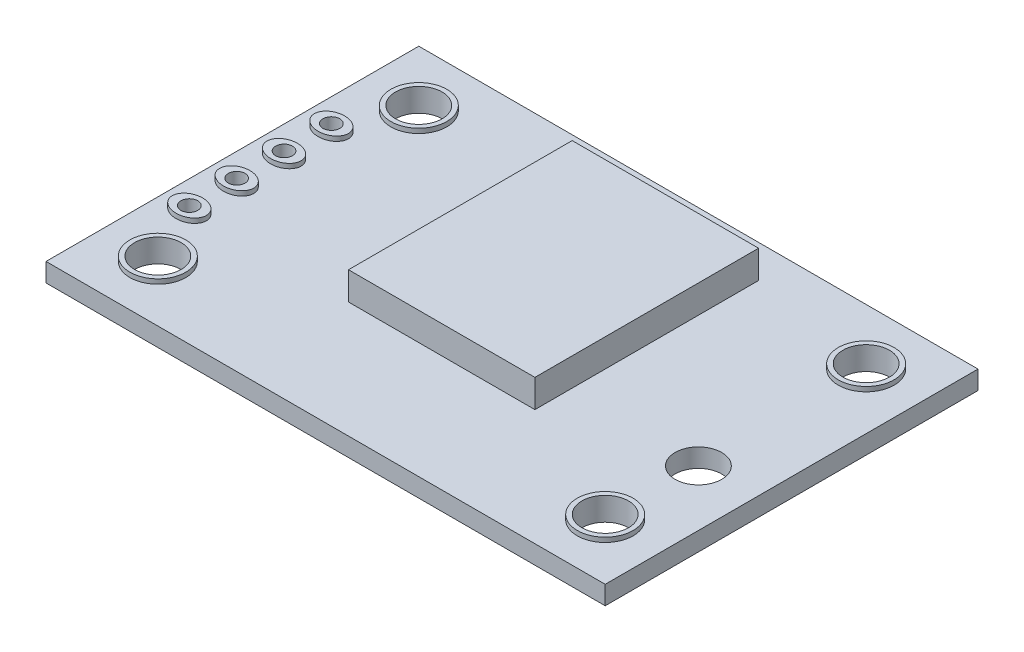
ISO-10303-21;
HEADER;
FILE_DESCRIPTION(('STEP AP214'),'2;1');
FILE_NAME('part.step','',(''),(''),'','','');
FILE_SCHEMA(('AUTOMOTIVE_DESIGN { 1 0 10303 214 1 1 1 1 }'));
ENDSEC;
DATA;
#1=APPLICATION_CONTEXT('core data for automotive mechanical design processes');
#2=APPLICATION_PROTOCOL_DEFINITION('international standard','automotive_design',2000,#1);
#3=PRODUCT_CONTEXT('',#1,'mechanical');
#4=PRODUCT('Part','Part','',(#3));
#5=PRODUCT_RELATED_PRODUCT_CATEGORY('part','',(#4));
#6=PRODUCT_DEFINITION_FORMATION('','',#4);
#7=PRODUCT_DEFINITION_CONTEXT('part definition',#1,'design');
#8=PRODUCT_DEFINITION('design','',#6,#7);
#9=PRODUCT_DEFINITION_SHAPE('','',#8);
#10=(LENGTH_UNIT() NAMED_UNIT(*) SI_UNIT(.MILLI.,.METRE.));
#11=(NAMED_UNIT(*) PLANE_ANGLE_UNIT() SI_UNIT($,.RADIAN.));
#12=(NAMED_UNIT(*) SI_UNIT($,.STERADIAN.) SOLID_ANGLE_UNIT());
#13=UNCERTAINTY_MEASURE_WITH_UNIT(LENGTH_MEASURE(1.E-05),#10,'distance_accuracy_value','');
#14=(GEOMETRIC_REPRESENTATION_CONTEXT(3) GLOBAL_UNCERTAINTY_ASSIGNED_CONTEXT((#13)) GLOBAL_UNIT_ASSIGNED_CONTEXT((#10,
#11,#12)) REPRESENTATION_CONTEXT('',''));
#15=CARTESIAN_POINT('',(0.,0.,0.));
#16=DIRECTION('',(0.,0.,1.));
#17=DIRECTION('',(1.,0.,0.));
#18=AXIS2_PLACEMENT_3D('',#15,#16,#17);
#19=CARTESIAN_POINT('',(0.,1.,0.));
#20=DIRECTION('',(0.,1.,0.));
#21=DIRECTION('',(0.,0.,1.));
#22=AXIS2_PLACEMENT_3D('',#19,#20,#21);
#23=PLANE('',#22);
#24=CARTESIAN_POINT('',(12.,1.,7.));
#25=DIRECTION('',(0.,1.,0.));
#26=DIRECTION('',(0.,0.,1.));
#27=AXIS2_PLACEMENT_3D('',#24,#25,#26);
#28=CIRCLE('',#27,1.5);
#29=CARTESIAN_POINT('',(12.,1.,8.5));
#30=VERTEX_POINT('',#29);
#31=EDGE_CURVE('E293',#30,#30,#28,.T.);
#32=ORIENTED_EDGE('',*,*,#31,.F.);
#33=EDGE_LOOP('',(#32));
#34=FACE_BOUND('',#33,.T.);
#35=CARTESIAN_POINT('',(-12.,1.,-7.));
#36=DIRECTION('',(0.,1.,0.));
#37=DIRECTION('',(0.,0.,1.));
#38=AXIS2_PLACEMENT_3D('',#35,#36,#37);
#39=CIRCLE('',#38,1.5);
#40=CARTESIAN_POINT('',(-12.,1.,-5.50000000000001));
#41=VERTEX_POINT('',#40);
#42=EDGE_CURVE('E309',#41,#41,#39,.T.);
#43=ORIENTED_EDGE('',*,*,#42,.F.);
#44=EDGE_LOOP('',(#43));
#45=FACE_BOUND('',#44,.T.);
#46=CARTESIAN_POINT('',(-13.5,1.,3.81));
#47=DIRECTION('',(0.,1.,0.));
#48=DIRECTION('',(1.,0.,0.));
#49=AXIS2_PLACEMENT_3D('',#46,#47,#48);
#50=ELLIPSE('',#49,0.916848000595627,0.710785016559697);
#51=CARTESIAN_POINT('',(-12.5831519994044,1.,3.81));
#52=VERTEX_POINT('',#51);
#53=EDGE_CURVE('E318',#52,#52,#50,.T.);
#54=ORIENTED_EDGE('',*,*,#53,.F.);
#55=EDGE_LOOP('',(#54));
#56=FACE_BOUND('',#55,.T.);
#57=CARTESIAN_POINT('',(-13.5,1.,1.27));
#58=DIRECTION('',(0.,1.,0.));
#59=DIRECTION('',(1.,0.,0.));
#60=AXIS2_PLACEMENT_3D('',#57,#58,#59);
#61=ELLIPSE('',#60,0.916848000595627,0.710785016559697);
#62=CARTESIAN_POINT('',(-12.5831519994044,1.,1.27));
#63=VERTEX_POINT('',#62);
#64=EDGE_CURVE('E354',#63,#63,#61,.T.);
#65=ORIENTED_EDGE('',*,*,#64,.F.);
#66=EDGE_LOOP('',(#65));
#67=FACE_BOUND('',#66,.T.);
#68=CARTESIAN_POINT('',(-13.5,1.,-1.27));
#69=DIRECTION('',(0.,1.,0.));
#70=DIRECTION('',(1.,0.,0.));
#71=AXIS2_PLACEMENT_3D('',#68,#69,#70);
#72=ELLIPSE('',#71,0.916848000595631,0.710785016559697);
#73=CARTESIAN_POINT('',(-12.5831519994044,1.,-1.27));
#74=VERTEX_POINT('',#73);
#75=EDGE_CURVE('E359',#74,#74,#72,.T.);
#76=ORIENTED_EDGE('',*,*,#75,.F.);
#77=EDGE_LOOP('',(#76));
#78=FACE_BOUND('',#77,.T.);
#79=CARTESIAN_POINT('',(-13.5,1.,-3.81));
#80=DIRECTION('',(0.,1.,0.));
#81=DIRECTION('',(1.,0.,0.));
#82=AXIS2_PLACEMENT_3D('',#79,#80,#81);
#83=ELLIPSE('',#82,0.916848000595629,0.710785016559697);
#84=CARTESIAN_POINT('',(-12.5831519994044,1.,-3.81));
#85=VERTEX_POINT('',#84);
#86=EDGE_CURVE('E263',#85,#85,#83,.T.);
#87=ORIENTED_EDGE('',*,*,#86,.F.);
#88=EDGE_LOOP('',(#87));
#89=FACE_BOUND('',#88,.T.);
#90=DIRECTION('',(0.,0.,-1.));
#91=VECTOR('',#90,1.);
#92=CARTESIAN_POINT('',(15.,1.,-10.));
#93=LINE('',#92,#91);
#94=CARTESIAN_POINT('',(15.,1.,10.));
#95=VERTEX_POINT('',#94);
#96=CARTESIAN_POINT('',(15.,1.,-10.));
#97=VERTEX_POINT('',#96);
#98=EDGE_CURVE('E171',#95,#97,#93,.T.);
#99=ORIENTED_EDGE('',*,*,#98,.T.);
#100=DIRECTION('',(-1.,0.,0.));
#101=VECTOR('',#100,1.);
#102=CARTESIAN_POINT('',(-15.,1.,-10.));
#103=LINE('',#102,#101);
#104=CARTESIAN_POINT('',(-15.,1.,-10.));
#105=VERTEX_POINT('',#104);
#106=EDGE_CURVE('E92',#97,#105,#103,.T.);
#107=ORIENTED_EDGE('',*,*,#106,.T.);
#108=DIRECTION('',(0.,0.,1.));
#109=VECTOR('',#108,1.);
#110=CARTESIAN_POINT('',(-15.,1.,-10.));
#111=LINE('',#110,#109);
#112=CARTESIAN_POINT('',(-15.,1.,10.));
#113=VERTEX_POINT('',#112);
#114=EDGE_CURVE('E174',#105,#113,#111,.T.);
#115=ORIENTED_EDGE('',*,*,#114,.T.);
#116=DIRECTION('',(1.,0.,0.));
#117=VECTOR('',#116,1.);
#118=CARTESIAN_POINT('',(-15.,1.,10.));
#119=LINE('',#118,#117);
#120=EDGE_CURVE('E64',#113,#95,#119,.T.);
#121=ORIENTED_EDGE('',*,*,#120,.T.);
#122=EDGE_LOOP('',(#99,#107,#115,#121));
#123=FACE_BOUND('',#122,.T.);
#124=CARTESIAN_POINT('',(12.,1.,2.00000000000002));
#125=DIRECTION('',(0.,1.,0.));
#126=DIRECTION('',(0.,0.,1.));
#127=AXIS2_PLACEMENT_3D('',#124,#125,#126);
#128=CIRCLE('',#127,1.25);
#129=CARTESIAN_POINT('',(12.,1.,3.25000000000002));
#130=VERTEX_POINT('',#129);
#131=EDGE_CURVE('E153',#130,#130,#128,.T.);
#132=ORIENTED_EDGE('',*,*,#131,.F.);
#133=EDGE_LOOP('',(#132));
#134=FACE_BOUND('',#133,.T.);
#135=DIRECTION('',(1.,0.,0.));
#136=VECTOR('',#135,1.);
#137=CARTESIAN_POINT('',(0.,1.,-8.22835765037289));
#138=LINE('',#137,#136);
#139=CARTESIAN_POINT('',(-5.,1.,-8.22835765037289));
#140=VERTEX_POINT('',#139);
#141=CARTESIAN_POINT('',(5.,1.,-8.22835765037289));
#142=VERTEX_POINT('',#141);
#143=EDGE_CURVE('E149',#140,#142,#138,.T.);
#144=ORIENTED_EDGE('',*,*,#143,.T.);
#145=DIRECTION('',(0.,0.,1.));
#146=VECTOR('',#145,1.);
#147=CARTESIAN_POINT('',(5.,1.,0.));
#148=LINE('',#147,#146);
#149=CARTESIAN_POINT('',(5.,1.,3.77164234962711));
#150=VERTEX_POINT('',#149);
#151=EDGE_CURVE('E138',#142,#150,#148,.T.);
#152=ORIENTED_EDGE('',*,*,#151,.T.);
#153=DIRECTION('',(-1.,0.,0.));
#154=VECTOR('',#153,1.);
#155=CARTESIAN_POINT('',(0.,1.,3.77164234962711));
#156=LINE('',#155,#154);
#157=CARTESIAN_POINT('',(-5.,1.,3.77164234962711));
#158=VERTEX_POINT('',#157);
#159=EDGE_CURVE('E139',#150,#158,#156,.T.);
#160=ORIENTED_EDGE('',*,*,#159,.T.);
#161=DIRECTION('',(0.,0.,-1.));
#162=VECTOR('',#161,1.);
#163=CARTESIAN_POINT('',(-5.,1.,0.));
#164=LINE('',#163,#162);
#165=EDGE_CURVE('E142',#158,#140,#164,.T.);
#166=ORIENTED_EDGE('',*,*,#165,.T.);
#167=EDGE_LOOP('',(#144,#152,#160,#166));
#168=FACE_BOUND('',#167,.T.);
#169=CARTESIAN_POINT('',(12.,1.,-7.));
#170=DIRECTION('',(0.,1.,0.));
#171=DIRECTION('',(0.,0.,1.));
#172=AXIS2_PLACEMENT_3D('',#169,#170,#171);
#173=CIRCLE('',#172,1.5);
#174=CARTESIAN_POINT('',(12.,1.,-5.50000000000001));
#175=VERTEX_POINT('',#174);
#176=EDGE_CURVE('E276',#175,#175,#173,.T.);
#177=ORIENTED_EDGE('',*,*,#176,.F.);
#178=EDGE_LOOP('',(#177));
#179=FACE_BOUND('',#178,.T.);
#180=CARTESIAN_POINT('',(-12.,1.,7.));
#181=DIRECTION('',(0.,1.,0.));
#182=DIRECTION('',(0.,0.,1.));
#183=AXIS2_PLACEMENT_3D('',#180,#181,#182);
#184=CIRCLE('',#183,1.5);
#185=CARTESIAN_POINT('',(-12.,1.,8.5));
#186=VERTEX_POINT('',#185);
#187=EDGE_CURVE('E279',#186,#186,#184,.T.);
#188=ORIENTED_EDGE('',*,*,#187,.F.);
#189=EDGE_LOOP('',(#188));
#190=FACE_BOUND('',#189,.T.);
#191=ADVANCED_FACE('F40',(#34,#45,#56,#67,#78,#89,#123,#134,#168,#179,#190),#23,.T.);
#192=CARTESIAN_POINT('',(0.,0.,0.));
#193=DIRECTION('',(0.,1.,0.));
#194=DIRECTION('',(0.,0.,1.));
#195=AXIS2_PLACEMENT_3D('',#192,#193,#194);
#196=PLANE('',#195);
#197=CARTESIAN_POINT('',(-13.5,0.,-3.81));
#198=DIRECTION('',(0.,1.,0.));
#199=DIRECTION('',(0.,0.,1.));
#200=AXIS2_PLACEMENT_3D('',#197,#198,#199);
#201=CIRCLE('',#200,0.45);
#202=CARTESIAN_POINT('',(-13.5,0.,-3.36));
#203=VERTEX_POINT('',#202);
#204=EDGE_CURVE('E288',#203,#203,#201,.F.);
#205=ORIENTED_EDGE('',*,*,#204,.F.);
#206=EDGE_LOOP('',(#205));
#207=FACE_BOUND('',#206,.T.);
#208=CARTESIAN_POINT('',(-13.5,0.,-1.27));
#209=DIRECTION('',(0.,1.,0.));
#210=DIRECTION('',(0.,0.,1.));
#211=AXIS2_PLACEMENT_3D('',#208,#209,#210);
#212=CIRCLE('',#211,0.45);
#213=CARTESIAN_POINT('',(-13.5,0.,-0.819999999999999));
#214=VERTEX_POINT('',#213);
#215=EDGE_CURVE('E379',#214,#214,#212,.F.);
#216=ORIENTED_EDGE('',*,*,#215,.F.);
#217=EDGE_LOOP('',(#216));
#218=FACE_BOUND('',#217,.T.);
#219=CARTESIAN_POINT('',(-13.5,0.,1.27));
#220=DIRECTION('',(0.,1.,0.));
#221=DIRECTION('',(0.,0.,1.));
#222=AXIS2_PLACEMENT_3D('',#219,#220,#221);
#223=CIRCLE('',#222,0.45);
#224=CARTESIAN_POINT('',(-13.5,0.,1.72));
#225=VERTEX_POINT('',#224);
#226=EDGE_CURVE('E382',#225,#225,#223,.F.);
#227=ORIENTED_EDGE('',*,*,#226,.F.);
#228=EDGE_LOOP('',(#227));
#229=FACE_BOUND('',#228,.T.);
#230=CARTESIAN_POINT('',(-13.5,0.,3.81));
#231=DIRECTION('',(0.,1.,0.));
#232=DIRECTION('',(0.,0.,1.));
#233=AXIS2_PLACEMENT_3D('',#230,#231,#232);
#234=CIRCLE('',#233,0.45);
#235=CARTESIAN_POINT('',(-13.5,0.,4.26));
#236=VERTEX_POINT('',#235);
#237=EDGE_CURVE('E387',#236,#236,#234,.F.);
#238=ORIENTED_EDGE('',*,*,#237,.F.);
#239=EDGE_LOOP('',(#238));
#240=FACE_BOUND('',#239,.T.);
#241=CARTESIAN_POINT('',(12.,0.,2.00000000000002));
#242=DIRECTION('',(0.,1.,0.));
#243=DIRECTION('',(0.,0.,1.));
#244=AXIS2_PLACEMENT_3D('',#241,#242,#243);
#245=CIRCLE('',#244,1.25);
#246=CARTESIAN_POINT('',(12.,0.,3.25000000000002));
#247=VERTEX_POINT('',#246);
#248=EDGE_CURVE('E152',#247,#247,#245,.T.);
#249=ORIENTED_EDGE('',*,*,#248,.T.);
#250=EDGE_LOOP('',(#249));
#251=FACE_BOUND('',#250,.T.);
#252=CARTESIAN_POINT('',(-12.,0.,7.));
#253=DIRECTION('',(0.,1.,0.));
#254=DIRECTION('',(0.,0.,-1.));
#255=AXIS2_PLACEMENT_3D('',#252,#253,#254);
#256=CIRCLE('',#255,1.25);
#257=CARTESIAN_POINT('',(-12.,0.,5.75));
#258=VERTEX_POINT('',#257);
#259=EDGE_CURVE('E156',#258,#258,#256,.T.);
#260=ORIENTED_EDGE('',*,*,#259,.T.);
#261=EDGE_LOOP('',(#260));
#262=FACE_BOUND('',#261,.T.);
#263=CARTESIAN_POINT('',(12.,0.,7.));
#264=DIRECTION('',(0.,1.,0.));
#265=DIRECTION('',(0.,0.,1.));
#266=AXIS2_PLACEMENT_3D('',#263,#264,#265);
#267=CIRCLE('',#266,1.25);
#268=CARTESIAN_POINT('',(12.,0.,8.25));
#269=VERTEX_POINT('',#268);
#270=EDGE_CURVE('E161',#269,#269,#267,.T.);
#271=ORIENTED_EDGE('',*,*,#270,.T.);
#272=EDGE_LOOP('',(#271));
#273=FACE_BOUND('',#272,.T.);
#274=CARTESIAN_POINT('',(12.,0.,-7.));
#275=DIRECTION('',(0.,1.,0.));
#276=DIRECTION('',(0.,0.,-1.));
#277=AXIS2_PLACEMENT_3D('',#274,#275,#276);
#278=CIRCLE('',#277,1.25);
#279=CARTESIAN_POINT('',(12.,0.,-8.25));
#280=VERTEX_POINT('',#279);
#281=EDGE_CURVE('E164',#280,#280,#278,.T.);
#282=ORIENTED_EDGE('',*,*,#281,.T.);
#283=EDGE_LOOP('',(#282));
#284=FACE_BOUND('',#283,.T.);
#285=CARTESIAN_POINT('',(-12.,0.,-7.));
#286=DIRECTION('',(0.,1.,0.));
#287=DIRECTION('',(0.,0.,1.));
#288=AXIS2_PLACEMENT_3D('',#285,#286,#287);
#289=CIRCLE('',#288,1.25);
#290=CARTESIAN_POINT('',(-12.,0.,-5.75));
#291=VERTEX_POINT('',#290);
#292=EDGE_CURVE('E167',#291,#291,#289,.T.);
#293=ORIENTED_EDGE('',*,*,#292,.T.);
#294=EDGE_LOOP('',(#293));
#295=FACE_BOUND('',#294,.T.);
#296=DIRECTION('',(0.,0.,-1.));
#297=VECTOR('',#296,1.);
#298=CARTESIAN_POINT('',(15.,0.,-10.));
#299=LINE('',#298,#297);
#300=CARTESIAN_POINT('',(15.,0.,10.));
#301=VERTEX_POINT('',#300);
#302=CARTESIAN_POINT('',(15.,0.,-10.));
#303=VERTEX_POINT('',#302);
#304=EDGE_CURVE('E170',#301,#303,#299,.T.);
#305=ORIENTED_EDGE('',*,*,#304,.F.);
#306=DIRECTION('',(1.,0.,0.));
#307=VECTOR('',#306,1.);
#308=CARTESIAN_POINT('',(-15.,0.,10.));
#309=LINE('',#308,#307);
#310=CARTESIAN_POINT('',(-15.,0.,10.));
#311=VERTEX_POINT('',#310);
#312=EDGE_CURVE('E85',#311,#301,#309,.T.);
#313=ORIENTED_EDGE('',*,*,#312,.F.);
#314=DIRECTION('',(0.,0.,1.));
#315=VECTOR('',#314,1.);
#316=CARTESIAN_POINT('',(-15.,0.,-10.));
#317=LINE('',#316,#315);
#318=CARTESIAN_POINT('',(-15.,0.,-10.));
#319=VERTEX_POINT('',#318);
#320=EDGE_CURVE('E182',#319,#311,#317,.T.);
#321=ORIENTED_EDGE('',*,*,#320,.F.);
#322=DIRECTION('',(-1.,0.,0.));
#323=VECTOR('',#322,1.);
#324=CARTESIAN_POINT('',(-15.,0.,-10.));
#325=LINE('',#324,#323);
#326=EDGE_CURVE('E180',#303,#319,#325,.T.);
#327=ORIENTED_EDGE('',*,*,#326,.F.);
#328=EDGE_LOOP('',(#305,#313,#321,#327));
#329=FACE_BOUND('',#328,.T.);
#330=ADVANCED_FACE('F195',(#207,#218,#229,#240,#251,#262,#273,#284,#295,#329),#196,.F.);
#331=CARTESIAN_POINT('',(15.,1.,-10.));
#332=DIRECTION('',(-1.,0.,0.));
#333=DIRECTION('',(0.,0.,1.));
#334=AXIS2_PLACEMENT_3D('',#331,#332,#333);
#335=PLANE('',#334);
#336=ORIENTED_EDGE('',*,*,#304,.T.);
#337=DIRECTION('',(0.,-1.,0.));
#338=VECTOR('',#337,1.);
#339=CARTESIAN_POINT('',(15.,1.,-10.));
#340=LINE('',#339,#338);
#341=EDGE_CURVE('E11',#97,#303,#340,.T.);
#342=ORIENTED_EDGE('',*,*,#341,.F.);
#343=ORIENTED_EDGE('',*,*,#98,.F.);
#344=DIRECTION('',(0.,-1.,0.));
#345=VECTOR('',#344,1.);
#346=CARTESIAN_POINT('',(15.,1.,10.));
#347=LINE('',#346,#345);
#348=EDGE_CURVE('E177',#95,#301,#347,.T.);
#349=ORIENTED_EDGE('',*,*,#348,.T.);
#350=EDGE_LOOP('',(#336,#342,#343,#349));
#351=FACE_BOUND('',#350,.T.);
#352=ADVANCED_FACE('F42',(#351),#335,.F.);
#353=CARTESIAN_POINT('',(-15.,1.,-10.));
#354=DIRECTION('',(0.,0.,1.));
#355=DIRECTION('',(1.,0.,0.));
#356=AXIS2_PLACEMENT_3D('',#353,#354,#355);
#357=PLANE('',#356);
#358=ORIENTED_EDGE('',*,*,#326,.T.);
#359=DIRECTION('',(0.,-1.,0.));
#360=VECTOR('',#359,1.);
#361=CARTESIAN_POINT('',(-15.,1.,-10.));
#362=LINE('',#361,#360);
#363=EDGE_CURVE('E48',#105,#319,#362,.T.);
#364=ORIENTED_EDGE('',*,*,#363,.F.);
#365=ORIENTED_EDGE('',*,*,#106,.F.);
#366=ORIENTED_EDGE('',*,*,#341,.T.);
#367=EDGE_LOOP('',(#358,#364,#365,#366));
#368=FACE_BOUND('',#367,.T.);
#369=ADVANCED_FACE('F210',(#368),#357,.F.);
#370=CARTESIAN_POINT('',(-15.,1.,-10.));
#371=DIRECTION('',(1.,0.,0.));
#372=DIRECTION('',(0.,0.,-1.));
#373=AXIS2_PLACEMENT_3D('',#370,#371,#372);
#374=PLANE('',#373);
#375=ORIENTED_EDGE('',*,*,#320,.T.);
#376=DIRECTION('',(0.,-1.,0.));
#377=VECTOR('',#376,1.);
#378=CARTESIAN_POINT('',(-15.,1.,10.));
#379=LINE('',#378,#377);
#380=EDGE_CURVE('E186',#113,#311,#379,.T.);
#381=ORIENTED_EDGE('',*,*,#380,.F.);
#382=ORIENTED_EDGE('',*,*,#114,.F.);
#383=ORIENTED_EDGE('',*,*,#363,.T.);
#384=EDGE_LOOP('',(#375,#381,#382,#383));
#385=FACE_BOUND('',#384,.T.);
#386=ADVANCED_FACE('F191',(#385),#374,.F.);
#387=CARTESIAN_POINT('',(-15.,1.,10.));
#388=DIRECTION('',(0.,0.,-1.));
#389=DIRECTION('',(-1.,0.,0.));
#390=AXIS2_PLACEMENT_3D('',#387,#388,#389);
#391=PLANE('',#390);
#392=ORIENTED_EDGE('',*,*,#312,.T.);
#393=ORIENTED_EDGE('',*,*,#348,.F.);
#394=ORIENTED_EDGE('',*,*,#120,.F.);
#395=ORIENTED_EDGE('',*,*,#380,.T.);
#396=EDGE_LOOP('',(#392,#393,#394,#395));
#397=FACE_BOUND('',#396,.T.);
#398=ADVANCED_FACE('F199',(#397),#391,.F.);
#399=CARTESIAN_POINT('',(-12.,1.,-7.));
#400=DIRECTION('',(0.,-1.,0.));
#401=DIRECTION('',(0.,0.,-1.));
#402=AXIS2_PLACEMENT_3D('',#399,#400,#401);
#403=CYLINDRICAL_SURFACE('',#402,1.25);
#404=ORIENTED_EDGE('',*,*,#292,.F.);
#405=EDGE_LOOP('',(#404));
#406=FACE_BOUND('',#405,.T.);
#407=CARTESIAN_POINT('',(-12.,1.25,-7.));
#408=DIRECTION('',(0.,1.,0.));
#409=DIRECTION('',(0.,0.,1.));
#410=AXIS2_PLACEMENT_3D('',#407,#408,#409);
#411=CIRCLE('',#410,1.25);
#412=CARTESIAN_POINT('',(-12.,1.25,-5.75));
#413=VERTEX_POINT('',#412);
#414=EDGE_CURVE('E305',#413,#413,#411,.T.);
#415=ORIENTED_EDGE('',*,*,#414,.T.);
#416=EDGE_LOOP('',(#415));
#417=FACE_BOUND('',#416,.T.);
#418=ADVANCED_FACE('F201',(#406,#417),#403,.F.);
#419=CARTESIAN_POINT('',(12.,1.,-7.));
#420=DIRECTION('',(0.,-1.,0.));
#421=DIRECTION('',(0.,0.,-1.));
#422=AXIS2_PLACEMENT_3D('',#419,#420,#421);
#423=CYLINDRICAL_SURFACE('',#422,1.25);
#424=ORIENTED_EDGE('',*,*,#281,.F.);
#425=EDGE_LOOP('',(#424));
#426=FACE_BOUND('',#425,.T.);
#427=CARTESIAN_POINT('',(12.,1.25,-7.));
#428=DIRECTION('',(0.,1.,0.));
#429=DIRECTION('',(0.,0.,1.));
#430=AXIS2_PLACEMENT_3D('',#427,#428,#429);
#431=CIRCLE('',#430,1.25);
#432=CARTESIAN_POINT('',(12.,1.25,-5.75));
#433=VERTEX_POINT('',#432);
#434=EDGE_CURVE('E297',#433,#433,#431,.T.);
#435=ORIENTED_EDGE('',*,*,#434,.T.);
#436=EDGE_LOOP('',(#435));
#437=FACE_BOUND('',#436,.T.);
#438=ADVANCED_FACE('F207',(#426,#437),#423,.F.);
#439=CARTESIAN_POINT('',(12.,1.,7.));
#440=DIRECTION('',(0.,-1.,0.));
#441=DIRECTION('',(0.,0.,-1.));
#442=AXIS2_PLACEMENT_3D('',#439,#440,#441);
#443=CYLINDRICAL_SURFACE('',#442,1.25);
#444=ORIENTED_EDGE('',*,*,#270,.F.);
#445=EDGE_LOOP('',(#444));
#446=FACE_BOUND('',#445,.T.);
#447=CARTESIAN_POINT('',(12.,1.25,7.));
#448=DIRECTION('',(0.,1.,0.));
#449=DIRECTION('',(0.,0.,1.));
#450=AXIS2_PLACEMENT_3D('',#447,#448,#449);
#451=CIRCLE('',#450,1.25);
#452=CARTESIAN_POINT('',(12.,1.25,8.25));
#453=VERTEX_POINT('',#452);
#454=EDGE_CURVE('E285',#453,#453,#451,.T.);
#455=ORIENTED_EDGE('',*,*,#454,.T.);
#456=EDGE_LOOP('',(#455));
#457=FACE_BOUND('',#456,.T.);
#458=ADVANCED_FACE('F225',(#446,#457),#443,.F.);
#459=CARTESIAN_POINT('',(-12.,1.,7.));
#460=DIRECTION('',(0.,-1.,0.));
#461=DIRECTION('',(0.,0.,-1.));
#462=AXIS2_PLACEMENT_3D('',#459,#460,#461);
#463=CYLINDRICAL_SURFACE('',#462,1.25);
#464=ORIENTED_EDGE('',*,*,#259,.F.);
#465=EDGE_LOOP('',(#464));
#466=FACE_BOUND('',#465,.T.);
#467=CARTESIAN_POINT('',(-12.,1.25,7.));
#468=DIRECTION('',(0.,1.,0.));
#469=DIRECTION('',(0.,0.,1.));
#470=AXIS2_PLACEMENT_3D('',#467,#468,#469);
#471=CIRCLE('',#470,1.25);
#472=CARTESIAN_POINT('',(-12.,1.25,8.25));
#473=VERTEX_POINT('',#472);
#474=EDGE_CURVE('E282',#473,#473,#471,.T.);
#475=ORIENTED_EDGE('',*,*,#474,.T.);
#476=EDGE_LOOP('',(#475));
#477=FACE_BOUND('',#476,.T.);
#478=ADVANCED_FACE('F229',(#466,#477),#463,.F.);
#479=CARTESIAN_POINT('',(12.,1.,2.00000000000002));
#480=DIRECTION('',(0.,-1.,0.));
#481=DIRECTION('',(0.,0.,-1.));
#482=AXIS2_PLACEMENT_3D('',#479,#480,#481);
#483=CYLINDRICAL_SURFACE('',#482,1.25);
#484=ORIENTED_EDGE('',*,*,#131,.T.);
#485=EDGE_LOOP('',(#484));
#486=FACE_BOUND('',#485,.T.);
#487=ORIENTED_EDGE('',*,*,#248,.F.);
#488=EDGE_LOOP('',(#487));
#489=FACE_BOUND('',#488,.T.);
#490=ADVANCED_FACE('F233',(#486,#489),#483,.F.);
#491=CARTESIAN_POINT('',(5.,2.5,-8.22835765037289));
#492=DIRECTION('',(-1.,0.,0.));
#493=DIRECTION('',(0.,0.,1.));
#494=AXIS2_PLACEMENT_3D('',#491,#492,#493);
#495=PLANE('',#494);
#496=ORIENTED_EDGE('',*,*,#151,.F.);
#497=DIRECTION('',(0.,-1.,0.));
#498=VECTOR('',#497,1.);
#499=CARTESIAN_POINT('',(5.,2.5,-8.22835765037289));
#500=LINE('',#499,#498);
#501=CARTESIAN_POINT('',(5.,2.5,-8.22835765037289));
#502=VERTEX_POINT('',#501);
#503=EDGE_CURVE('E119',#502,#142,#500,.T.);
#504=ORIENTED_EDGE('',*,*,#503,.F.);
#505=DIRECTION('',(0.,0.,-1.));
#506=VECTOR('',#505,1.);
#507=CARTESIAN_POINT('',(5.,2.5,-8.22835765037289));
#508=LINE('',#507,#506);
#509=CARTESIAN_POINT('',(5.,2.5,3.77164234962711));
#510=VERTEX_POINT('',#509);
#511=EDGE_CURVE('E126',#510,#502,#508,.T.);
#512=ORIENTED_EDGE('',*,*,#511,.F.);
#513=DIRECTION('',(0.,-1.,0.));
#514=VECTOR('',#513,1.);
#515=CARTESIAN_POINT('',(5.,2.5,3.77164234962711));
#516=LINE('',#515,#514);
#517=EDGE_CURVE('E270',#510,#150,#516,.T.);
#518=ORIENTED_EDGE('',*,*,#517,.T.);
#519=EDGE_LOOP('',(#496,#504,#512,#518));
#520=FACE_BOUND('',#519,.T.);
#521=ADVANCED_FACE('F136',(#520),#495,.F.);
#522=CARTESIAN_POINT('',(-5.,2.5,-8.22835765037289));
#523=DIRECTION('',(0.,0.,1.));
#524=DIRECTION('',(1.,0.,0.));
#525=AXIS2_PLACEMENT_3D('',#522,#523,#524);
#526=PLANE('',#525);
#527=ORIENTED_EDGE('',*,*,#143,.F.);
#528=DIRECTION('',(0.,-1.,0.));
#529=VECTOR('',#528,1.);
#530=CARTESIAN_POINT('',(-5.,2.5,-8.22835765037289));
#531=LINE('',#530,#529);
#532=CARTESIAN_POINT('',(-5.,2.5,-8.22835765037289));
#533=VERTEX_POINT('',#532);
#534=EDGE_CURVE('E122',#533,#140,#531,.T.);
#535=ORIENTED_EDGE('',*,*,#534,.F.);
#536=DIRECTION('',(-1.,0.,0.));
#537=VECTOR('',#536,1.);
#538=CARTESIAN_POINT('',(-5.,2.5,-8.22835765037289));
#539=LINE('',#538,#537);
#540=EDGE_CURVE('E115',#502,#533,#539,.T.);
#541=ORIENTED_EDGE('',*,*,#540,.F.);
#542=ORIENTED_EDGE('',*,*,#503,.T.);
#543=EDGE_LOOP('',(#527,#535,#541,#542));
#544=FACE_BOUND('',#543,.T.);
#545=ADVANCED_FACE('F117',(#544),#526,.F.);
#546=CARTESIAN_POINT('',(-5.,2.5,-8.22835765037289));
#547=DIRECTION('',(1.,0.,0.));
#548=DIRECTION('',(0.,0.,-1.));
#549=AXIS2_PLACEMENT_3D('',#546,#547,#548);
#550=PLANE('',#549);
#551=ORIENTED_EDGE('',*,*,#165,.F.);
#552=DIRECTION('',(0.,-1.,0.));
#553=VECTOR('',#552,1.);
#554=CARTESIAN_POINT('',(-5.,2.5,3.77164234962711));
#555=LINE('',#554,#553);
#556=CARTESIAN_POINT('',(-5.,2.5,3.77164234962711));
#557=VERTEX_POINT('',#556);
#558=EDGE_CURVE('E55',#557,#158,#555,.T.);
#559=ORIENTED_EDGE('',*,*,#558,.F.);
#560=DIRECTION('',(0.,0.,1.));
#561=VECTOR('',#560,1.);
#562=CARTESIAN_POINT('',(-5.,2.5,-8.22835765037289));
#563=LINE('',#562,#561);
#564=EDGE_CURVE('E125',#533,#557,#563,.T.);
#565=ORIENTED_EDGE('',*,*,#564,.F.);
#566=ORIENTED_EDGE('',*,*,#534,.T.);
#567=EDGE_LOOP('',(#551,#559,#565,#566));
#568=FACE_BOUND('',#567,.T.);
#569=ADVANCED_FACE('F242',(#568),#550,.F.);
#570=CARTESIAN_POINT('',(-5.,2.5,3.77164234962711));
#571=DIRECTION('',(0.,0.,-1.));
#572=DIRECTION('',(-1.,0.,0.));
#573=AXIS2_PLACEMENT_3D('',#570,#571,#572);
#574=PLANE('',#573);
#575=ORIENTED_EDGE('',*,*,#159,.F.);
#576=ORIENTED_EDGE('',*,*,#517,.F.);
#577=DIRECTION('',(1.,0.,0.));
#578=VECTOR('',#577,1.);
#579=CARTESIAN_POINT('',(-5.,2.5,3.77164234962711));
#580=LINE('',#579,#578);
#581=EDGE_CURVE('E130',#557,#510,#580,.T.);
#582=ORIENTED_EDGE('',*,*,#581,.F.);
#583=ORIENTED_EDGE('',*,*,#558,.T.);
#584=EDGE_LOOP('',(#575,#576,#582,#583));
#585=FACE_BOUND('',#584,.T.);
#586=ADVANCED_FACE('F245',(#585),#574,.F.);
#587=CARTESIAN_POINT('',(0.,2.5,0.));
#588=DIRECTION('',(0.,1.,0.));
#589=DIRECTION('',(0.,0.,1.));
#590=AXIS2_PLACEMENT_3D('',#587,#588,#589);
#591=PLANE('',#590);
#592=ORIENTED_EDGE('',*,*,#511,.T.);
#593=ORIENTED_EDGE('',*,*,#540,.T.);
#594=ORIENTED_EDGE('',*,*,#564,.T.);
#595=ORIENTED_EDGE('',*,*,#581,.T.);
#596=EDGE_LOOP('',(#592,#593,#594,#595));
#597=FACE_BOUND('',#596,.T.);
#598=ADVANCED_FACE('F129',(#597),#591,.T.);
#599=CARTESIAN_POINT('',(-13.5,1.25,-3.81));
#600=DIRECTION('',(0.,1.,0.));
#601=DIRECTION('',(0.,0.,1.));
#602=AXIS2_PLACEMENT_3D('',#599,#600,#601);
#603=PLANE('',#602);
#604=CARTESIAN_POINT('',(-13.5,1.25,-3.81));
#605=DIRECTION('',(0.,1.,0.));
#606=DIRECTION('',(1.,0.,0.));
#607=AXIS2_PLACEMENT_3D('',#604,#605,#606);
#608=ELLIPSE('',#607,0.916848000595629,0.710785016559697);
#609=CARTESIAN_POINT('',(-12.5831519994044,1.25,-3.81));
#610=VERTEX_POINT('',#609);
#611=EDGE_CURVE('E134',#610,#610,#608,.T.);
#612=ORIENTED_EDGE('',*,*,#611,.T.);
#613=EDGE_LOOP('',(#612));
#614=FACE_BOUND('',#613,.T.);
#615=CARTESIAN_POINT('',(-13.5,1.25,-3.81));
#616=DIRECTION('',(0.,1.,0.));
#617=DIRECTION('',(0.,0.,1.));
#618=AXIS2_PLACEMENT_3D('',#615,#616,#617);
#619=CIRCLE('',#618,0.450000000000002);
#620=CARTESIAN_POINT('',(-13.5,1.25,-3.36));
#621=VERTEX_POINT('',#620);
#622=EDGE_CURVE('E264',#621,#621,#619,.T.);
#623=ORIENTED_EDGE('',*,*,#622,.F.);
#624=EDGE_LOOP('',(#623));
#625=FACE_BOUND('',#624,.T.);
#626=ADVANCED_FACE('F251',(#614,#625),#603,.T.);
#627=DIRECTION('',(0.,-1.,0.));
#628=VECTOR('',#627,1.);
#629=SURFACE_OF_LINEAR_EXTRUSION('',#608,#628);
#630=ORIENTED_EDGE('',*,*,#611,.F.);
#631=EDGE_LOOP('',(#630));
#632=FACE_BOUND('',#631,.T.);
#633=ORIENTED_EDGE('',*,*,#86,.T.);
#634=EDGE_LOOP('',(#633));
#635=FACE_BOUND('',#634,.T.);
#636=ADVANCED_FACE('F252',(#632,#635),#629,.F.);
#637=CARTESIAN_POINT('',(-13.5,1.25,-3.81));
#638=DIRECTION('',(0.,-1.,0.));
#639=DIRECTION('',(0.,0.,-1.));
#640=AXIS2_PLACEMENT_3D('',#637,#638,#639);
#641=CYLINDRICAL_SURFACE('',#640,0.450000000000002);
#642=ORIENTED_EDGE('',*,*,#622,.T.);
#643=EDGE_LOOP('',(#642));
#644=FACE_BOUND('',#643,.T.);
#645=ORIENTED_EDGE('',*,*,#204,.T.);
#646=EDGE_LOOP('',(#645));
#647=FACE_BOUND('',#646,.T.);
#648=ADVANCED_FACE('F256',(#644,#647),#641,.F.);
#649=CARTESIAN_POINT('',(-13.5,1.25,-1.27));
#650=DIRECTION('',(0.,1.,0.));
#651=DIRECTION('',(0.,0.,1.));
#652=AXIS2_PLACEMENT_3D('',#649,#650,#651);
#653=PLANE('',#652);
#654=CARTESIAN_POINT('',(-13.5,1.25,-1.27));
#655=DIRECTION('',(0.,1.,0.));
#656=DIRECTION('',(1.,0.,0.));
#657=AXIS2_PLACEMENT_3D('',#654,#655,#656);
#658=ELLIPSE('',#657,0.916848000595631,0.710785016559697);
#659=CARTESIAN_POINT('',(-12.5831519994044,1.25,-1.27));
#660=VERTEX_POINT('',#659);
#661=EDGE_CURVE('E360',#660,#660,#658,.T.);
#662=ORIENTED_EDGE('',*,*,#661,.T.);
#663=EDGE_LOOP('',(#662));
#664=FACE_BOUND('',#663,.T.);
#665=CARTESIAN_POINT('',(-13.5,1.25,-1.27));
#666=DIRECTION('',(0.,1.,0.));
#667=DIRECTION('',(0.,0.,1.));
#668=AXIS2_PLACEMENT_3D('',#665,#666,#667);
#669=CIRCLE('',#668,0.450000000000004);
#670=CARTESIAN_POINT('',(-13.5,1.25,-0.819999999999996));
#671=VERTEX_POINT('',#670);
#672=EDGE_CURVE('E353',#671,#671,#669,.T.);
#673=ORIENTED_EDGE('',*,*,#672,.F.);
#674=EDGE_LOOP('',(#673));
#675=FACE_BOUND('',#674,.T.);
#676=ADVANCED_FACE('F366',(#664,#675),#653,.T.);
#677=DIRECTION('',(0.,-1.,0.));
#678=VECTOR('',#677,1.);
#679=SURFACE_OF_LINEAR_EXTRUSION('',#658,#678);
#680=ORIENTED_EDGE('',*,*,#661,.F.);
#681=EDGE_LOOP('',(#680));
#682=FACE_BOUND('',#681,.T.);
#683=ORIENTED_EDGE('',*,*,#75,.T.);
#684=EDGE_LOOP('',(#683));
#685=FACE_BOUND('',#684,.T.);
#686=ADVANCED_FACE('F364',(#682,#685),#679,.F.);
#687=CARTESIAN_POINT('',(-13.5,1.25,-1.27));
#688=DIRECTION('',(0.,-1.,0.));
#689=DIRECTION('',(0.,0.,-1.));
#690=AXIS2_PLACEMENT_3D('',#687,#688,#689);
#691=CYLINDRICAL_SURFACE('',#690,0.450000000000004);
#692=ORIENTED_EDGE('',*,*,#672,.T.);
#693=EDGE_LOOP('',(#692));
#694=FACE_BOUND('',#693,.T.);
#695=ORIENTED_EDGE('',*,*,#215,.T.);
#696=EDGE_LOOP('',(#695));
#697=FACE_BOUND('',#696,.T.);
#698=ADVANCED_FACE('F342',(#694,#697),#691,.F.);
#699=CARTESIAN_POINT('',(-13.5,1.25,1.27));
#700=DIRECTION('',(0.,-1.,0.));
#701=DIRECTION('',(0.,0.,-1.));
#702=AXIS2_PLACEMENT_3D('',#699,#700,#701);
#703=PLANE('',#702);
#704=CARTESIAN_POINT('',(-13.5,1.25,1.27));
#705=DIRECTION('',(0.,1.,0.));
#706=DIRECTION('',(1.,0.,0.));
#707=AXIS2_PLACEMENT_3D('',#704,#705,#706);
#708=ELLIPSE('',#707,0.916848000595627,0.710785016559697);
#709=CARTESIAN_POINT('',(-12.5831519994044,1.25,1.27));
#710=VERTEX_POINT('',#709);
#711=EDGE_CURVE('E349',#710,#710,#708,.T.);
#712=ORIENTED_EDGE('',*,*,#711,.T.);
#713=EDGE_LOOP('',(#712));
#714=FACE_BOUND('',#713,.T.);
#715=CARTESIAN_POINT('',(-13.5,1.25,1.27));
#716=DIRECTION('',(0.,1.,0.));
#717=DIRECTION('',(0.,0.,-1.));
#718=AXIS2_PLACEMENT_3D('',#715,#716,#717);
#719=CIRCLE('',#718,0.45);
#720=CARTESIAN_POINT('',(-13.5,1.25,0.819999999999999));
#721=VERTEX_POINT('',#720);
#722=EDGE_CURVE('E323',#721,#721,#719,.T.);
#723=ORIENTED_EDGE('',*,*,#722,.F.);
#724=EDGE_LOOP('',(#723));
#725=FACE_BOUND('',#724,.T.);
#726=ADVANCED_FACE('F339',(#714,#725),#703,.F.);
#727=DIRECTION('',(0.,-1.,0.));
#728=VECTOR('',#727,1.);
#729=SURFACE_OF_LINEAR_EXTRUSION('',#708,#728);
#730=ORIENTED_EDGE('',*,*,#711,.F.);
#731=EDGE_LOOP('',(#730));
#732=FACE_BOUND('',#731,.T.);
#733=ORIENTED_EDGE('',*,*,#64,.T.);
#734=EDGE_LOOP('',(#733));
#735=FACE_BOUND('',#734,.T.);
#736=ADVANCED_FACE('F337',(#732,#735),#729,.F.);
#737=CARTESIAN_POINT('',(-13.5,1.25,1.27));
#738=DIRECTION('',(0.,-1.,0.));
#739=DIRECTION('',(0.,0.,-1.));
#740=AXIS2_PLACEMENT_3D('',#737,#738,#739);
#741=CYLINDRICAL_SURFACE('',#740,0.45);
#742=ORIENTED_EDGE('',*,*,#722,.T.);
#743=EDGE_LOOP('',(#742));
#744=FACE_BOUND('',#743,.T.);
#745=ORIENTED_EDGE('',*,*,#226,.T.);
#746=EDGE_LOOP('',(#745));
#747=FACE_BOUND('',#746,.T.);
#748=ADVANCED_FACE('F334',(#744,#747),#741,.F.);
#749=CARTESIAN_POINT('',(-13.5,1.25,3.81));
#750=DIRECTION('',(0.,-1.,0.));
#751=DIRECTION('',(0.,0.,-1.));
#752=AXIS2_PLACEMENT_3D('',#749,#750,#751);
#753=PLANE('',#752);
#754=CARTESIAN_POINT('',(-13.5,1.25,3.81));
#755=DIRECTION('',(0.,1.,0.));
#756=DIRECTION('',(1.,0.,0.));
#757=AXIS2_PLACEMENT_3D('',#754,#755,#756);
#758=ELLIPSE('',#757,0.916848000595627,0.710785016559697);
#759=CARTESIAN_POINT('',(-12.5831519994044,1.25,3.81));
#760=VERTEX_POINT('',#759);
#761=EDGE_CURVE('E319',#760,#760,#758,.T.);
#762=ORIENTED_EDGE('',*,*,#761,.T.);
#763=EDGE_LOOP('',(#762));
#764=FACE_BOUND('',#763,.T.);
#765=CARTESIAN_POINT('',(-13.5,1.25,3.81));
#766=DIRECTION('',(0.,1.,0.));
#767=DIRECTION('',(0.,0.,-1.));
#768=AXIS2_PLACEMENT_3D('',#765,#766,#767);
#769=CIRCLE('',#768,0.45);
#770=CARTESIAN_POINT('',(-13.5,1.25,3.36));
#771=VERTEX_POINT('',#770);
#772=EDGE_CURVE('E313',#771,#771,#769,.T.);
#773=ORIENTED_EDGE('',*,*,#772,.F.);
#774=EDGE_LOOP('',(#773));
#775=FACE_BOUND('',#774,.T.);
#776=ADVANCED_FACE('F331',(#764,#775),#753,.F.);
#777=DIRECTION('',(0.,-1.,0.));
#778=VECTOR('',#777,1.);
#779=SURFACE_OF_LINEAR_EXTRUSION('',#758,#778);
#780=ORIENTED_EDGE('',*,*,#761,.F.);
#781=EDGE_LOOP('',(#780));
#782=FACE_BOUND('',#781,.T.);
#783=ORIENTED_EDGE('',*,*,#53,.T.);
#784=EDGE_LOOP('',(#783));
#785=FACE_BOUND('',#784,.T.);
#786=ADVANCED_FACE('F326',(#782,#785),#779,.F.);
#787=CARTESIAN_POINT('',(-13.5,1.25,3.81));
#788=DIRECTION('',(0.,-1.,0.));
#789=DIRECTION('',(0.,0.,-1.));
#790=AXIS2_PLACEMENT_3D('',#787,#788,#789);
#791=CYLINDRICAL_SURFACE('',#790,0.45);
#792=ORIENTED_EDGE('',*,*,#772,.T.);
#793=EDGE_LOOP('',(#792));
#794=FACE_BOUND('',#793,.T.);
#795=ORIENTED_EDGE('',*,*,#237,.T.);
#796=EDGE_LOOP('',(#795));
#797=FACE_BOUND('',#796,.T.);
#798=ADVANCED_FACE('F330',(#794,#797),#791,.F.);
#799=CARTESIAN_POINT('',(-12.,1.25,-7.));
#800=DIRECTION('',(0.,1.,0.));
#801=DIRECTION('',(0.,0.,1.));
#802=AXIS2_PLACEMENT_3D('',#799,#800,#801);
#803=PLANE('',#802);
#804=CARTESIAN_POINT('',(-12.,1.25,-7.));
#805=DIRECTION('',(0.,1.,0.));
#806=DIRECTION('',(0.,0.,1.));
#807=AXIS2_PLACEMENT_3D('',#804,#805,#806);
#808=CIRCLE('',#807,1.5);
#809=CARTESIAN_POINT('',(-12.,1.25,-5.50000000000001));
#810=VERTEX_POINT('',#809);
#811=EDGE_CURVE('E310',#810,#810,#808,.T.);
#812=ORIENTED_EDGE('',*,*,#811,.T.);
#813=EDGE_LOOP('',(#812));
#814=FACE_BOUND('',#813,.T.);
#815=ORIENTED_EDGE('',*,*,#414,.F.);
#816=EDGE_LOOP('',(#815));
#817=FACE_BOUND('',#816,.T.);
#818=ADVANCED_FACE('F405',(#814,#817),#803,.T.);
#819=CARTESIAN_POINT('',(-12.,1.25,-7.));
#820=DIRECTION('',(0.,-1.,0.));
#821=DIRECTION('',(0.,0.,-1.));
#822=AXIS2_PLACEMENT_3D('',#819,#820,#821);
#823=CYLINDRICAL_SURFACE('',#822,1.5);
#824=ORIENTED_EDGE('',*,*,#811,.F.);
#825=EDGE_LOOP('',(#824));
#826=FACE_BOUND('',#825,.T.);
#827=ORIENTED_EDGE('',*,*,#42,.T.);
#828=EDGE_LOOP('',(#827));
#829=FACE_BOUND('',#828,.T.);
#830=ADVANCED_FACE('F407',(#826,#829),#823,.T.);
#831=CARTESIAN_POINT('',(12.,1.25,-7.));
#832=DIRECTION('',(0.,1.,0.));
#833=DIRECTION('',(0.,0.,1.));
#834=AXIS2_PLACEMENT_3D('',#831,#832,#833);
#835=PLANE('',#834);
#836=CARTESIAN_POINT('',(12.,1.25,-7.));
#837=DIRECTION('',(0.,1.,0.));
#838=DIRECTION('',(0.,0.,1.));
#839=AXIS2_PLACEMENT_3D('',#836,#837,#838);
#840=CIRCLE('',#839,1.5);
#841=CARTESIAN_POINT('',(12.,1.25,-5.50000000000001));
#842=VERTEX_POINT('',#841);
#843=EDGE_CURVE('E302',#842,#842,#840,.T.);
#844=ORIENTED_EDGE('',*,*,#843,.T.);
#845=EDGE_LOOP('',(#844));
#846=FACE_BOUND('',#845,.T.);
#847=ORIENTED_EDGE('',*,*,#434,.F.);
#848=EDGE_LOOP('',(#847));
#849=FACE_BOUND('',#848,.T.);
#850=ADVANCED_FACE('F414',(#846,#849),#835,.T.);
#851=CARTESIAN_POINT('',(12.,1.25,-7.));
#852=DIRECTION('',(0.,-1.,0.));
#853=DIRECTION('',(0.,0.,-1.));
#854=AXIS2_PLACEMENT_3D('',#851,#852,#853);
#855=CYLINDRICAL_SURFACE('',#854,1.5);
#856=ORIENTED_EDGE('',*,*,#843,.F.);
#857=EDGE_LOOP('',(#856));
#858=FACE_BOUND('',#857,.T.);
#859=ORIENTED_EDGE('',*,*,#176,.T.);
#860=EDGE_LOOP('',(#859));
#861=FACE_BOUND('',#860,.T.);
#862=ADVANCED_FACE('F419',(#858,#861),#855,.T.);
#863=CARTESIAN_POINT('',(12.,1.25,7.));
#864=DIRECTION('',(0.,1.,0.));
#865=DIRECTION('',(0.,0.,1.));
#866=AXIS2_PLACEMENT_3D('',#863,#864,#865);
#867=PLANE('',#866);
#868=CARTESIAN_POINT('',(12.,1.25,7.));
#869=DIRECTION('',(0.,1.,0.));
#870=DIRECTION('',(0.,0.,1.));
#871=AXIS2_PLACEMENT_3D('',#868,#869,#870);
#872=CIRCLE('',#871,1.5);
#873=CARTESIAN_POINT('',(12.,1.25,8.5));
#874=VERTEX_POINT('',#873);
#875=EDGE_CURVE('E294',#874,#874,#872,.T.);
#876=ORIENTED_EDGE('',*,*,#875,.T.);
#877=EDGE_LOOP('',(#876));
#878=FACE_BOUND('',#877,.T.);
#879=ORIENTED_EDGE('',*,*,#454,.F.);
#880=EDGE_LOOP('',(#879));
#881=FACE_BOUND('',#880,.T.);
#882=ADVANCED_FACE('F422',(#878,#881),#867,.T.);
#883=CARTESIAN_POINT('',(12.,1.25,7.));
#884=DIRECTION('',(0.,-1.,0.));
#885=DIRECTION('',(0.,0.,-1.));
#886=AXIS2_PLACEMENT_3D('',#883,#884,#885);
#887=CYLINDRICAL_SURFACE('',#886,1.5);
#888=ORIENTED_EDGE('',*,*,#875,.F.);
#889=EDGE_LOOP('',(#888));
#890=FACE_BOUND('',#889,.T.);
#891=ORIENTED_EDGE('',*,*,#31,.T.);
#892=EDGE_LOOP('',(#891));
#893=FACE_BOUND('',#892,.T.);
#894=ADVANCED_FACE('F427',(#890,#893),#887,.T.);
#895=CARTESIAN_POINT('',(-12.,1.25,7.));
#896=DIRECTION('',(0.,1.,0.));
#897=DIRECTION('',(0.,0.,1.));
#898=AXIS2_PLACEMENT_3D('',#895,#896,#897);
#899=PLANE('',#898);
#900=CARTESIAN_POINT('',(-12.,1.25,7.));
#901=DIRECTION('',(0.,1.,0.));
#902=DIRECTION('',(0.,0.,1.));
#903=AXIS2_PLACEMENT_3D('',#900,#901,#902);
#904=CIRCLE('',#903,1.5);
#905=CARTESIAN_POINT('',(-12.,1.25,8.5));
#906=VERTEX_POINT('',#905);
#907=EDGE_CURVE('E281',#906,#906,#904,.T.);
#908=ORIENTED_EDGE('',*,*,#907,.T.);
#909=EDGE_LOOP('',(#908));
#910=FACE_BOUND('',#909,.T.);
#911=ORIENTED_EDGE('',*,*,#474,.F.);
#912=EDGE_LOOP('',(#911));
#913=FACE_BOUND('',#912,.T.);
#914=ADVANCED_FACE('F430',(#910,#913),#899,.T.);
#915=CARTESIAN_POINT('',(-12.,1.25,7.));
#916=DIRECTION('',(0.,-1.,0.));
#917=DIRECTION('',(0.,0.,-1.));
#918=AXIS2_PLACEMENT_3D('',#915,#916,#917);
#919=CYLINDRICAL_SURFACE('',#918,1.5);
#920=ORIENTED_EDGE('',*,*,#907,.F.);
#921=EDGE_LOOP('',(#920));
#922=FACE_BOUND('',#921,.T.);
#923=ORIENTED_EDGE('',*,*,#187,.T.);
#924=EDGE_LOOP('',(#923));
#925=FACE_BOUND('',#924,.T.);
#926=ADVANCED_FACE('F435',(#922,#925),#919,.T.);
#927=CLOSED_SHELL('',(#191,#330,#352,#369,#386,#398,#418,#438,#458,#478,#490,#521,#545,#569,
#586,#598,#626,#636,#648,#676,#686,#698,#726,#736,#748,#776,#786,#798,#818,#830,#850,#862,#882,
#894,#914,#926));
#928=MANIFOLD_SOLID_BREP('B2',#927);
#929=ADVANCED_BREP_SHAPE_REPRESENTATION('',(#18,#928),#14);
#930=SHAPE_DEFINITION_REPRESENTATION(#9,#929);
ENDSEC;
END-ISO-10303-21;
